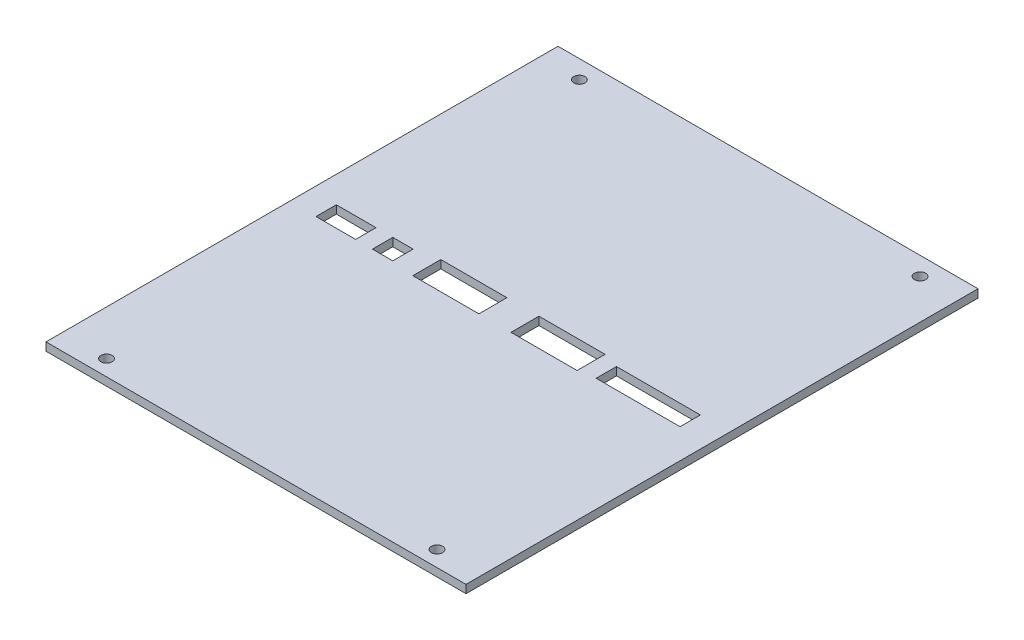
ISO-10303-21;
HEADER;
FILE_DESCRIPTION(('STEP AP214'),'2;1');
FILE_NAME('part.step','',(''),(''),'','','');
FILE_SCHEMA(('AUTOMOTIVE_DESIGN { 1 0 10303 214 1 1 1 1 }'));
ENDSEC;
DATA;
#1=APPLICATION_CONTEXT('core data for automotive mechanical design processes');
#2=APPLICATION_PROTOCOL_DEFINITION('international standard','automotive_design',2000,#1);
#3=PRODUCT_CONTEXT('',#1,'mechanical');
#4=PRODUCT('Part','Part','',(#3));
#5=PRODUCT_RELATED_PRODUCT_CATEGORY('part','',(#4));
#6=PRODUCT_DEFINITION_FORMATION('','',#4);
#7=PRODUCT_DEFINITION_CONTEXT('part definition',#1,'design');
#8=PRODUCT_DEFINITION('design','',#6,#7);
#9=PRODUCT_DEFINITION_SHAPE('','',#8);
#10=(LENGTH_UNIT() NAMED_UNIT(*) SI_UNIT(.MILLI.,.METRE.));
#11=(NAMED_UNIT(*) PLANE_ANGLE_UNIT() SI_UNIT($,.RADIAN.));
#12=(NAMED_UNIT(*) SI_UNIT($,.STERADIAN.) SOLID_ANGLE_UNIT());
#13=UNCERTAINTY_MEASURE_WITH_UNIT(LENGTH_MEASURE(1.E-05),#10,'distance_accuracy_value','');
#14=(GEOMETRIC_REPRESENTATION_CONTEXT(3) GLOBAL_UNCERTAINTY_ASSIGNED_CONTEXT((#13)) GLOBAL_UNIT_ASSIGNED_CONTEXT((#10,
#11,#12)) REPRESENTATION_CONTEXT('',''));
#15=CARTESIAN_POINT('',(0.,0.,0.));
#16=DIRECTION('',(0.,0.,1.));
#17=DIRECTION('',(1.,0.,0.));
#18=AXIS2_PLACEMENT_3D('',#15,#16,#17);
#19=CARTESIAN_POINT('',(0.,1.6,0.));
#20=DIRECTION('',(0.,-1.,0.));
#21=DIRECTION('',(0.,0.,-1.));
#22=AXIS2_PLACEMENT_3D('',#19,#20,#21);
#23=PLANE('',#22);
#24=CARTESIAN_POINT('',(-9.75999999999997,1.6,-27.8625473621053));
#25=DIRECTION('',(0.,1.,0.));
#26=DIRECTION('',(0.,0.,1.));
#27=AXIS2_PLACEMENT_3D('',#24,#25,#26);
#28=CIRCLE('',#27,1.1);
#29=CARTESIAN_POINT('',(-9.75999999999997,1.6,-26.7625473621053));
#30=VERTEX_POINT('',#29);
#31=EDGE_CURVE('E426',#30,#30,#28,.T.);
#32=ORIENTED_EDGE('',*,*,#31,.F.);
#33=EDGE_LOOP('',(#32));
#34=FACE_BOUND('',#33,.T.);
#35=CARTESIAN_POINT('',(57.24,1.6,-27.8625473621053));
#36=DIRECTION('',(0.,1.,0.));
#37=DIRECTION('',(0.,0.,1.));
#38=AXIS2_PLACEMENT_3D('',#35,#36,#37);
#39=CIRCLE('',#38,1.1);
#40=CARTESIAN_POINT('',(57.24,1.6,-26.7625473621053));
#41=VERTEX_POINT('',#40);
#42=EDGE_CURVE('E436',#41,#41,#39,.T.);
#43=ORIENTED_EDGE('',*,*,#42,.F.);
#44=EDGE_LOOP('',(#43));
#45=FACE_BOUND('',#44,.T.);
#46=CARTESIAN_POINT('',(56.24,1.6,66.1374526378947));
#47=DIRECTION('',(0.,1.,0.));
#48=DIRECTION('',(0.,0.,1.));
#49=AXIS2_PLACEMENT_3D('',#46,#47,#48);
#50=CIRCLE('',#49,1.1);
#51=CARTESIAN_POINT('',(56.24,1.6,67.2374526378947));
#52=VERTEX_POINT('',#51);
#53=EDGE_CURVE('E219',#52,#52,#50,.T.);
#54=ORIENTED_EDGE('',*,*,#53,.F.);
#55=EDGE_LOOP('',(#54));
#56=FACE_BOUND('',#55,.T.);
#57=CARTESIAN_POINT('',(-8.75999999999998,1.6,66.1374526378947));
#58=DIRECTION('',(0.,1.,0.));
#59=DIRECTION('',(0.,0.,1.));
#60=AXIS2_PLACEMENT_3D('',#57,#58,#59);
#61=CIRCLE('',#60,1.1);
#62=CARTESIAN_POINT('',(-8.75999999999998,1.6,67.2374526378947));
#63=VERTEX_POINT('',#62);
#64=EDGE_CURVE('E230',#63,#63,#61,.T.);
#65=ORIENTED_EDGE('',*,*,#64,.F.);
#66=EDGE_LOOP('',(#65));
#67=FACE_BOUND('',#66,.T.);
#68=DIRECTION('',(1.,0.,0.));
#69=VECTOR('',#68,1.);
#70=CARTESIAN_POINT('',(-1.25999999999997,1.6,21.3374526378947));
#71=LINE('',#70,#69);
#72=CARTESIAN_POINT('',(-1.25999999999997,1.6,21.3374526378947));
#73=VERTEX_POINT('',#72);
#74=CARTESIAN_POINT('',(2.74000000000003,1.6,21.3374526378947));
#75=VERTEX_POINT('',#74);
#76=EDGE_CURVE('E238',#73,#75,#71,.T.);
#77=ORIENTED_EDGE('',*,*,#76,.F.);
#78=DIRECTION('',(0.,0.,1.));
#79=VECTOR('',#78,1.);
#80=CARTESIAN_POINT('',(-1.25999999999997,1.6,17.3374526378947));
#81=LINE('',#80,#79);
#82=CARTESIAN_POINT('',(-1.25999999999997,1.6,17.3374526378947));
#83=VERTEX_POINT('',#82);
#84=EDGE_CURVE('E236',#83,#73,#81,.T.);
#85=ORIENTED_EDGE('',*,*,#84,.F.);
#86=DIRECTION('',(-1.,0.,0.));
#87=VECTOR('',#86,1.);
#88=CARTESIAN_POINT('',(-1.25999999999997,1.6,17.3374526378947));
#89=LINE('',#88,#87);
#90=CARTESIAN_POINT('',(2.74000000000003,1.6,17.3374526378947));
#91=VERTEX_POINT('',#90);
#92=EDGE_CURVE('E244',#91,#83,#89,.T.);
#93=ORIENTED_EDGE('',*,*,#92,.F.);
#94=DIRECTION('',(0.,0.,-1.));
#95=VECTOR('',#94,1.);
#96=CARTESIAN_POINT('',(2.74000000000003,1.6,17.3374526378947));
#97=LINE('',#96,#95);
#98=EDGE_CURVE('E241',#75,#91,#97,.T.);
#99=ORIENTED_EDGE('',*,*,#98,.F.);
#100=EDGE_LOOP('',(#77,#85,#93,#99));
#101=FACE_BOUND('',#100,.T.);
#102=DIRECTION('',(1.,0.,0.));
#103=VECTOR('',#102,1.);
#104=CARTESIAN_POINT('',(26.54,1.6,21.8874526378947));
#105=LINE('',#104,#103);
#106=CARTESIAN_POINT('',(26.54,1.6,21.8874526378947));
#107=VERTEX_POINT('',#106);
#108=CARTESIAN_POINT('',(39.54,1.6,21.8874526378947));
#109=VERTEX_POINT('',#108);
#110=EDGE_CURVE('E258',#107,#109,#105,.T.);
#111=ORIENTED_EDGE('',*,*,#110,.F.);
#112=DIRECTION('',(0.,0.,1.));
#113=VECTOR('',#112,1.);
#114=CARTESIAN_POINT('',(26.54,1.6,16.3874526378947));
#115=LINE('',#114,#113);
#116=CARTESIAN_POINT('',(26.54,1.6,16.3874526378947));
#117=VERTEX_POINT('',#116);
#118=EDGE_CURVE('E250',#117,#107,#115,.T.);
#119=ORIENTED_EDGE('',*,*,#118,.F.);
#120=DIRECTION('',(-1.,0.,0.));
#121=VECTOR('',#120,1.);
#122=CARTESIAN_POINT('',(26.54,1.6,16.3874526378947));
#123=LINE('',#122,#121);
#124=CARTESIAN_POINT('',(39.54,1.6,16.3874526378947));
#125=VERTEX_POINT('',#124);
#126=EDGE_CURVE('E264',#125,#117,#123,.T.);
#127=ORIENTED_EDGE('',*,*,#126,.F.);
#128=DIRECTION('',(0.,0.,-1.));
#129=VECTOR('',#128,1.);
#130=CARTESIAN_POINT('',(39.54,1.6,16.3874526378947));
#131=LINE('',#130,#129);
#132=EDGE_CURVE('E261',#109,#125,#131,.T.);
#133=ORIENTED_EDGE('',*,*,#132,.F.);
#134=EDGE_LOOP('',(#111,#119,#127,#133));
#135=FACE_BOUND('',#134,.T.);
#136=DIRECTION('',(1.,0.,0.));
#137=VECTOR('',#136,1.);
#138=CARTESIAN_POINT('',(-12.36,1.6,21.3374526378947));
#139=LINE('',#138,#137);
#140=CARTESIAN_POINT('',(-12.36,1.6,21.3374526378947));
#141=VERTEX_POINT('',#140);
#142=CARTESIAN_POINT('',(-4.55999999999997,1.6,21.3374526378947));
#143=VERTEX_POINT('',#142);
#144=EDGE_CURVE('E278',#141,#143,#139,.T.);
#145=ORIENTED_EDGE('',*,*,#144,.F.);
#146=DIRECTION('',(0.,0.,1.));
#147=VECTOR('',#146,1.);
#148=CARTESIAN_POINT('',(-12.36,1.6,17.3374526378947));
#149=LINE('',#148,#147);
#150=CARTESIAN_POINT('',(-12.36,1.6,17.3374526378947));
#151=VERTEX_POINT('',#150);
#152=EDGE_CURVE('E270',#151,#141,#149,.T.);
#153=ORIENTED_EDGE('',*,*,#152,.F.);
#154=DIRECTION('',(-1.,0.,0.));
#155=VECTOR('',#154,1.);
#156=CARTESIAN_POINT('',(-12.36,1.6,17.3374526378947));
#157=LINE('',#156,#155);
#158=CARTESIAN_POINT('',(-4.55999999999997,1.6,17.3374526378947));
#159=VERTEX_POINT('',#158);
#160=EDGE_CURVE('E284',#159,#151,#157,.T.);
#161=ORIENTED_EDGE('',*,*,#160,.F.);
#162=DIRECTION('',(0.,0.,-1.));
#163=VECTOR('',#162,1.);
#164=CARTESIAN_POINT('',(-4.55999999999997,1.6,17.3374526378947));
#165=LINE('',#164,#163);
#166=EDGE_CURVE('E281',#143,#159,#165,.T.);
#167=ORIENTED_EDGE('',*,*,#166,.F.);
#168=EDGE_LOOP('',(#145,#153,#161,#167));
#169=FACE_BOUND('',#168,.T.);
#170=DIRECTION('',(1.,0.,0.));
#171=VECTOR('',#170,1.);
#172=CARTESIAN_POINT('',(42.74,1.6,21.3374526378947));
#173=LINE('',#172,#171);
#174=CARTESIAN_POINT('',(42.74,1.6,21.3374526378947));
#175=VERTEX_POINT('',#174);
#176=CARTESIAN_POINT('',(59.24,1.6,21.3374526378947));
#177=VERTEX_POINT('',#176);
#178=EDGE_CURVE('E298',#175,#177,#173,.T.);
#179=ORIENTED_EDGE('',*,*,#178,.F.);
#180=DIRECTION('',(0.,0.,1.));
#181=VECTOR('',#180,1.);
#182=CARTESIAN_POINT('',(42.74,1.6,17.3374526378947));
#183=LINE('',#182,#181);
#184=CARTESIAN_POINT('',(42.74,1.6,17.3374526378947));
#185=VERTEX_POINT('',#184);
#186=EDGE_CURVE('E290',#185,#175,#183,.T.);
#187=ORIENTED_EDGE('',*,*,#186,.F.);
#188=DIRECTION('',(-1.,0.,0.));
#189=VECTOR('',#188,1.);
#190=CARTESIAN_POINT('',(42.74,1.6,17.3374526378947));
#191=LINE('',#190,#189);
#192=CARTESIAN_POINT('',(59.24,1.6,17.3374526378947));
#193=VERTEX_POINT('',#192);
#194=EDGE_CURVE('E304',#193,#185,#191,.T.);
#195=ORIENTED_EDGE('',*,*,#194,.F.);
#196=DIRECTION('',(0.,0.,-1.));
#197=VECTOR('',#196,1.);
#198=CARTESIAN_POINT('',(59.24,1.6,17.3374526378947));
#199=LINE('',#198,#197);
#200=EDGE_CURVE('E301',#177,#193,#199,.T.);
#201=ORIENTED_EDGE('',*,*,#200,.F.);
#202=EDGE_LOOP('',(#179,#187,#195,#201));
#203=FACE_BOUND('',#202,.T.);
#204=DIRECTION('',(1.,0.,0.));
#205=VECTOR('',#204,1.);
#206=CARTESIAN_POINT('',(7.24000000000003,1.6,21.8874526378947));
#207=LINE('',#206,#205);
#208=CARTESIAN_POINT('',(7.24000000000003,1.6,21.8874526378947));
#209=VERTEX_POINT('',#208);
#210=CARTESIAN_POINT('',(20.24,1.6,21.8874526378947));
#211=VERTEX_POINT('',#210);
#212=EDGE_CURVE('E318',#209,#211,#207,.T.);
#213=ORIENTED_EDGE('',*,*,#212,.F.);
#214=DIRECTION('',(0.,0.,1.));
#215=VECTOR('',#214,1.);
#216=CARTESIAN_POINT('',(7.24000000000003,1.6,16.3874526378947));
#217=LINE('',#216,#215);
#218=CARTESIAN_POINT('',(7.24000000000003,1.6,16.3874526378947));
#219=VERTEX_POINT('',#218);
#220=EDGE_CURVE('E310',#219,#209,#217,.T.);
#221=ORIENTED_EDGE('',*,*,#220,.F.);
#222=DIRECTION('',(-1.,0.,0.));
#223=VECTOR('',#222,1.);
#224=CARTESIAN_POINT('',(7.24000000000003,1.6,16.3874526378947));
#225=LINE('',#224,#223);
#226=CARTESIAN_POINT('',(20.24,1.6,16.3874526378948));
#227=VERTEX_POINT('',#226);
#228=EDGE_CURVE('E324',#227,#219,#225,.T.);
#229=ORIENTED_EDGE('',*,*,#228,.F.);
#230=DIRECTION('',(0.,0.,-1.));
#231=VECTOR('',#230,1.);
#232=CARTESIAN_POINT('',(20.24,1.6,16.3874526378948));
#233=LINE('',#232,#231);
#234=EDGE_CURVE('E321',#211,#227,#233,.T.);
#235=ORIENTED_EDGE('',*,*,#234,.F.);
#236=EDGE_LOOP('',(#213,#221,#229,#235));
#237=FACE_BOUND('',#236,.T.);
#238=DIRECTION('',(-1.,0.,0.));
#239=VECTOR('',#238,1.);
#240=CARTESIAN_POINT('',(-17.76,1.6,69.2374526378948));
#241=LINE('',#240,#239);
#242=CARTESIAN_POINT('',(65.04,1.6,69.2374526378948));
#243=VERTEX_POINT('',#242);
#244=CARTESIAN_POINT('',(-17.56,1.6,69.2374526378948));
#245=VERTEX_POINT('',#244);
#246=EDGE_CURVE('E217',#243,#245,#241,.T.);
#247=ORIENTED_EDGE('',*,*,#246,.F.);
#248=DIRECTION('',(0.,0.,1.));
#249=VECTOR('',#248,1.);
#250=CARTESIAN_POINT('',(65.04,1.6,69.2374526378948));
#251=LINE('',#250,#249);
#252=CARTESIAN_POINT('',(65.04,1.6,-31.4625473621052));
#253=VERTEX_POINT('',#252);
#254=EDGE_CURVE('E53',#253,#243,#251,.T.);
#255=ORIENTED_EDGE('',*,*,#254,.F.);
#256=DIRECTION('',(1.,0.,0.));
#257=VECTOR('',#256,1.);
#258=CARTESIAN_POINT('',(65.24,1.6,-31.4625473621052));
#259=LINE('',#258,#257);
#260=CARTESIAN_POINT('',(-17.56,1.6,-31.4625473621053));
#261=VERTEX_POINT('',#260);
#262=EDGE_CURVE('E214',#261,#253,#259,.T.);
#263=ORIENTED_EDGE('',*,*,#262,.F.);
#264=DIRECTION('',(0.,0.,-1.));
#265=VECTOR('',#264,1.);
#266=CARTESIAN_POINT('',(-17.56,1.6,-31.4625473621053));
#267=LINE('',#266,#265);
#268=EDGE_CURVE('E419',#245,#261,#267,.T.);
#269=ORIENTED_EDGE('',*,*,#268,.F.);
#270=EDGE_LOOP('',(#247,#255,#263,#269));
#271=FACE_BOUND('',#270,.T.);
#272=ADVANCED_FACE('F38',(#34,#45,#56,#67,#101,#135,#169,#203,#237,#271),#23,.F.);
#273=CARTESIAN_POINT('',(0.,0.,0.));
#274=DIRECTION('',(0.,-1.,0.));
#275=DIRECTION('',(0.,0.,-1.));
#276=AXIS2_PLACEMENT_3D('',#273,#274,#275);
#277=PLANE('',#276);
#278=DIRECTION('',(0.,0.,1.));
#279=VECTOR('',#278,1.);
#280=CARTESIAN_POINT('',(65.04,0.,69.2374526378948));
#281=LINE('',#280,#279);
#282=CARTESIAN_POINT('',(65.04,0.,-31.4625473621052));
#283=VERTEX_POINT('',#282);
#284=CARTESIAN_POINT('',(65.04,0.,69.2374526378948));
#285=VERTEX_POINT('',#284);
#286=EDGE_CURVE('E198',#283,#285,#281,.T.);
#287=ORIENTED_EDGE('',*,*,#286,.T.);
#288=DIRECTION('',(1.,0.,0.));
#289=VECTOR('',#288,1.);
#290=CARTESIAN_POINT('',(-17.76,0.,69.2374526378948));
#291=LINE('',#290,#289);
#292=CARTESIAN_POINT('',(-17.56,0.,69.2374526378948));
#293=VERTEX_POINT('',#292);
#294=EDGE_CURVE('E221',#293,#285,#291,.T.);
#295=ORIENTED_EDGE('',*,*,#294,.F.);
#296=DIRECTION('',(0.,0.,-1.));
#297=VECTOR('',#296,1.);
#298=CARTESIAN_POINT('',(-17.56,0.,-31.4625473621053));
#299=LINE('',#298,#297);
#300=CARTESIAN_POINT('',(-17.56,0.,-31.4625473621053));
#301=VERTEX_POINT('',#300);
#302=EDGE_CURVE('E61',#293,#301,#299,.T.);
#303=ORIENTED_EDGE('',*,*,#302,.T.);
#304=DIRECTION('',(-1.,0.,0.));
#305=VECTOR('',#304,1.);
#306=CARTESIAN_POINT('',(65.24,0.,-31.4625473621052));
#307=LINE('',#306,#305);
#308=EDGE_CURVE('E212',#283,#301,#307,.T.);
#309=ORIENTED_EDGE('',*,*,#308,.F.);
#310=EDGE_LOOP('',(#287,#295,#303,#309));
#311=FACE_BOUND('',#310,.T.);
#312=CARTESIAN_POINT('',(-9.75999999999997,0.,-27.8625473621053));
#313=DIRECTION('',(0.,1.,0.));
#314=DIRECTION('',(0.,0.,1.));
#315=AXIS2_PLACEMENT_3D('',#312,#313,#314);
#316=CIRCLE('',#315,1.1);
#317=CARTESIAN_POINT('',(-9.75999999999997,0.,-26.7625473621053));
#318=VERTEX_POINT('',#317);
#319=EDGE_CURVE('E433',#318,#318,#316,.T.);
#320=ORIENTED_EDGE('',*,*,#319,.T.);
#321=EDGE_LOOP('',(#320));
#322=FACE_BOUND('',#321,.T.);
#323=CARTESIAN_POINT('',(57.24,0.,-27.8625473621053));
#324=DIRECTION('',(0.,1.,0.));
#325=DIRECTION('',(0.,0.,1.));
#326=AXIS2_PLACEMENT_3D('',#323,#324,#325);
#327=CIRCLE('',#326,1.1);
#328=CARTESIAN_POINT('',(57.24,0.,-26.7625473621053));
#329=VERTEX_POINT('',#328);
#330=EDGE_CURVE('E439',#329,#329,#327,.T.);
#331=ORIENTED_EDGE('',*,*,#330,.T.);
#332=EDGE_LOOP('',(#331));
#333=FACE_BOUND('',#332,.T.);
#334=CARTESIAN_POINT('',(56.24,0.,66.1374526378947));
#335=DIRECTION('',(0.,-1.,0.));
#336=DIRECTION('',(0.,0.,-1.));
#337=AXIS2_PLACEMENT_3D('',#334,#335,#336);
#338=CIRCLE('',#337,1.1);
#339=CARTESIAN_POINT('',(56.24,0.,65.0374526378947));
#340=VERTEX_POINT('',#339);
#341=EDGE_CURVE('E227',#340,#340,#338,.T.);
#342=ORIENTED_EDGE('',*,*,#341,.F.);
#343=EDGE_LOOP('',(#342));
#344=FACE_BOUND('',#343,.T.);
#345=CARTESIAN_POINT('',(-8.75999999999998,0.,66.1374526378947));
#346=DIRECTION('',(0.,-1.,0.));
#347=DIRECTION('',(0.,0.,-1.));
#348=AXIS2_PLACEMENT_3D('',#345,#346,#347);
#349=CIRCLE('',#348,1.1);
#350=CARTESIAN_POINT('',(-8.75999999999998,0.,65.0374526378947));
#351=VERTEX_POINT('',#350);
#352=EDGE_CURVE('E233',#351,#351,#349,.T.);
#353=ORIENTED_EDGE('',*,*,#352,.F.);
#354=EDGE_LOOP('',(#353));
#355=FACE_BOUND('',#354,.T.);
#356=DIRECTION('',(0.,0.,-1.));
#357=VECTOR('',#356,1.);
#358=CARTESIAN_POINT('',(-1.25999999999997,0.,0.));
#359=LINE('',#358,#357);
#360=CARTESIAN_POINT('',(-1.25999999999997,0.,21.3374526378947));
#361=VERTEX_POINT('',#360);
#362=CARTESIAN_POINT('',(-1.25999999999997,0.,17.3374526378947));
#363=VERTEX_POINT('',#362);
#364=EDGE_CURVE('E11',#361,#363,#359,.T.);
#365=ORIENTED_EDGE('',*,*,#364,.F.);
#366=DIRECTION('',(-1.,0.,0.));
#367=VECTOR('',#366,1.);
#368=CARTESIAN_POINT('',(0.,0.,21.3374526378947));
#369=LINE('',#368,#367);
#370=CARTESIAN_POINT('',(2.74000000000003,0.,21.3374526378947));
#371=VERTEX_POINT('',#370);
#372=EDGE_CURVE('E372',#371,#361,#369,.T.);
#373=ORIENTED_EDGE('',*,*,#372,.F.);
#374=DIRECTION('',(0.,0.,1.));
#375=VECTOR('',#374,1.);
#376=CARTESIAN_POINT('',(2.74000000000003,0.,0.));
#377=LINE('',#376,#375);
#378=CARTESIAN_POINT('',(2.74000000000003,0.,17.3374526378947));
#379=VERTEX_POINT('',#378);
#380=EDGE_CURVE('E374',#379,#371,#377,.T.);
#381=ORIENTED_EDGE('',*,*,#380,.F.);
#382=DIRECTION('',(1.,0.,0.));
#383=VECTOR('',#382,1.);
#384=CARTESIAN_POINT('',(0.,0.,17.3374526378947));
#385=LINE('',#384,#383);
#386=EDGE_CURVE('E46',#363,#379,#385,.T.);
#387=ORIENTED_EDGE('',*,*,#386,.F.);
#388=EDGE_LOOP('',(#365,#373,#381,#387));
#389=FACE_BOUND('',#388,.T.);
#390=DIRECTION('',(0.,0.,-1.));
#391=VECTOR('',#390,1.);
#392=CARTESIAN_POINT('',(26.54,0.,0.));
#393=LINE('',#392,#391);
#394=CARTESIAN_POINT('',(26.54,0.,21.8874526378947));
#395=VERTEX_POINT('',#394);
#396=CARTESIAN_POINT('',(26.54,0.,16.3874526378947));
#397=VERTEX_POINT('',#396);
#398=EDGE_CURVE('E370',#395,#397,#393,.T.);
#399=ORIENTED_EDGE('',*,*,#398,.F.);
#400=DIRECTION('',(-1.,0.,0.));
#401=VECTOR('',#400,1.);
#402=CARTESIAN_POINT('',(0.,0.,21.8874526378947));
#403=LINE('',#402,#401);
#404=CARTESIAN_POINT('',(39.54,0.,21.8874526378947));
#405=VERTEX_POINT('',#404);
#406=EDGE_CURVE('E363',#405,#395,#403,.T.);
#407=ORIENTED_EDGE('',*,*,#406,.F.);
#408=DIRECTION('',(0.,0.,1.));
#409=VECTOR('',#408,1.);
#410=CARTESIAN_POINT('',(39.54,0.,0.));
#411=LINE('',#410,#409);
#412=CARTESIAN_POINT('',(39.54,0.,16.3874526378947));
#413=VERTEX_POINT('',#412);
#414=EDGE_CURVE('E365',#413,#405,#411,.T.);
#415=ORIENTED_EDGE('',*,*,#414,.F.);
#416=DIRECTION('',(1.,0.,0.));
#417=VECTOR('',#416,1.);
#418=CARTESIAN_POINT('',(0.,0.,16.3874526378947));
#419=LINE('',#418,#417);
#420=EDGE_CURVE('E368',#397,#413,#419,.T.);
#421=ORIENTED_EDGE('',*,*,#420,.F.);
#422=EDGE_LOOP('',(#399,#407,#415,#421));
#423=FACE_BOUND('',#422,.T.);
#424=DIRECTION('',(0.,0.,-1.));
#425=VECTOR('',#424,1.);
#426=CARTESIAN_POINT('',(-12.36,0.,0.));
#427=LINE('',#426,#425);
#428=CARTESIAN_POINT('',(-12.36,0.,21.3374526378947));
#429=VERTEX_POINT('',#428);
#430=CARTESIAN_POINT('',(-12.36,0.,17.3374526378947));
#431=VERTEX_POINT('',#430);
#432=EDGE_CURVE('E361',#429,#431,#427,.T.);
#433=ORIENTED_EDGE('',*,*,#432,.F.);
#434=DIRECTION('',(-1.,0.,0.));
#435=VECTOR('',#434,1.);
#436=CARTESIAN_POINT('',(0.,0.,21.3374526378947));
#437=LINE('',#436,#435);
#438=CARTESIAN_POINT('',(-4.55999999999997,0.,21.3374526378947));
#439=VERTEX_POINT('',#438);
#440=EDGE_CURVE('E354',#439,#429,#437,.T.);
#441=ORIENTED_EDGE('',*,*,#440,.F.);
#442=DIRECTION('',(0.,0.,1.));
#443=VECTOR('',#442,1.);
#444=CARTESIAN_POINT('',(-4.55999999999998,0.,0.));
#445=LINE('',#444,#443);
#446=CARTESIAN_POINT('',(-4.55999999999997,0.,17.3374526378947));
#447=VERTEX_POINT('',#446);
#448=EDGE_CURVE('E356',#447,#439,#445,.T.);
#449=ORIENTED_EDGE('',*,*,#448,.F.);
#450=DIRECTION('',(1.,0.,0.));
#451=VECTOR('',#450,1.);
#452=CARTESIAN_POINT('',(0.,0.,17.3374526378947));
#453=LINE('',#452,#451);
#454=EDGE_CURVE('E359',#431,#447,#453,.T.);
#455=ORIENTED_EDGE('',*,*,#454,.F.);
#456=EDGE_LOOP('',(#433,#441,#449,#455));
#457=FACE_BOUND('',#456,.T.);
#458=DIRECTION('',(0.,0.,-1.));
#459=VECTOR('',#458,1.);
#460=CARTESIAN_POINT('',(42.74,0.,0.));
#461=LINE('',#460,#459);
#462=CARTESIAN_POINT('',(42.74,0.,21.3374526378947));
#463=VERTEX_POINT('',#462);
#464=CARTESIAN_POINT('',(42.74,0.,17.3374526378947));
#465=VERTEX_POINT('',#464);
#466=EDGE_CURVE('E352',#463,#465,#461,.T.);
#467=ORIENTED_EDGE('',*,*,#466,.F.);
#468=DIRECTION('',(-1.,0.,0.));
#469=VECTOR('',#468,1.);
#470=CARTESIAN_POINT('',(0.,0.,21.3374526378947));
#471=LINE('',#470,#469);
#472=CARTESIAN_POINT('',(59.24,0.,21.3374526378947));
#473=VERTEX_POINT('',#472);
#474=EDGE_CURVE('E345',#473,#463,#471,.T.);
#475=ORIENTED_EDGE('',*,*,#474,.F.);
#476=DIRECTION('',(0.,0.,1.));
#477=VECTOR('',#476,1.);
#478=CARTESIAN_POINT('',(59.24,0.,0.));
#479=LINE('',#478,#477);
#480=CARTESIAN_POINT('',(59.24,0.,17.3374526378947));
#481=VERTEX_POINT('',#480);
#482=EDGE_CURVE('E347',#481,#473,#479,.T.);
#483=ORIENTED_EDGE('',*,*,#482,.F.);
#484=DIRECTION('',(1.,0.,0.));
#485=VECTOR('',#484,1.);
#486=CARTESIAN_POINT('',(0.,0.,17.3374526378947));
#487=LINE('',#486,#485);
#488=EDGE_CURVE('E350',#465,#481,#487,.T.);
#489=ORIENTED_EDGE('',*,*,#488,.F.);
#490=EDGE_LOOP('',(#467,#475,#483,#489));
#491=FACE_BOUND('',#490,.T.);
#492=DIRECTION('',(0.,0.,-1.));
#493=VECTOR('',#492,1.);
#494=CARTESIAN_POINT('',(7.24000000000003,0.,0.));
#495=LINE('',#494,#493);
#496=CARTESIAN_POINT('',(7.24000000000003,0.,21.8874526378947));
#497=VERTEX_POINT('',#496);
#498=CARTESIAN_POINT('',(7.24000000000003,0.,16.3874526378947));
#499=VERTEX_POINT('',#498);
#500=EDGE_CURVE('E343',#497,#499,#495,.T.);
#501=ORIENTED_EDGE('',*,*,#500,.F.);
#502=DIRECTION('',(-1.,0.,0.));
#503=VECTOR('',#502,1.);
#504=CARTESIAN_POINT('',(0.,0.,21.8874526378947));
#505=LINE('',#504,#503);
#506=CARTESIAN_POINT('',(20.24,0.,21.8874526378947));
#507=VERTEX_POINT('',#506);
#508=EDGE_CURVE('E330',#507,#497,#505,.T.);
#509=ORIENTED_EDGE('',*,*,#508,.F.);
#510=DIRECTION('',(0.,0.,1.));
#511=VECTOR('',#510,1.);
#512=CARTESIAN_POINT('',(20.24,0.,0.));
#513=LINE('',#512,#511);
#514=CARTESIAN_POINT('',(20.24,0.,16.3874526378948));
#515=VERTEX_POINT('',#514);
#516=EDGE_CURVE('E338',#515,#507,#513,.T.);
#517=ORIENTED_EDGE('',*,*,#516,.F.);
#518=DIRECTION('',(1.,0.,0.));
#519=VECTOR('',#518,1.);
#520=CARTESIAN_POINT('',(0.,0.,16.3874526378947));
#521=LINE('',#520,#519);
#522=EDGE_CURVE('E341',#499,#515,#521,.T.);
#523=ORIENTED_EDGE('',*,*,#522,.F.);
#524=EDGE_LOOP('',(#501,#509,#517,#523));
#525=FACE_BOUND('',#524,.T.);
#526=ADVANCED_FACE('F40',(#311,#322,#333,#344,#355,#389,#423,#457,#491,#525),#277,.T.);
#527=CARTESIAN_POINT('',(7.24000000000003,-47.4,16.3874526378947));
#528=DIRECTION('',(-1.,0.,0.));
#529=DIRECTION('',(0.,0.,1.));
#530=AXIS2_PLACEMENT_3D('',#527,#528,#529);
#531=PLANE('',#530);
#532=ORIENTED_EDGE('',*,*,#500,.T.);
#533=DIRECTION('',(0.,1.,0.));
#534=VECTOR('',#533,1.);
#535=CARTESIAN_POINT('',(7.24000000000003,-47.4,16.3874526378947));
#536=LINE('',#535,#534);
#537=EDGE_CURVE('E328',#499,#219,#536,.T.);
#538=ORIENTED_EDGE('',*,*,#537,.T.);
#539=ORIENTED_EDGE('',*,*,#220,.T.);
#540=DIRECTION('',(0.,1.,0.));
#541=VECTOR('',#540,1.);
#542=CARTESIAN_POINT('',(7.24000000000003,-47.4,21.8874526378947));
#543=LINE('',#542,#541);
#544=EDGE_CURVE('E327',#497,#209,#543,.T.);
#545=ORIENTED_EDGE('',*,*,#544,.F.);
#546=EDGE_LOOP('',(#532,#538,#539,#545));
#547=FACE_BOUND('',#546,.T.);
#548=ADVANCED_FACE('F530',(#547),#531,.F.);
#549=CARTESIAN_POINT('',(7.24000000000003,-47.4,16.3874526378947));
#550=DIRECTION('',(0.,0.,-1.));
#551=DIRECTION('',(-1.,0.,0.));
#552=AXIS2_PLACEMENT_3D('',#549,#550,#551);
#553=PLANE('',#552);
#554=ORIENTED_EDGE('',*,*,#522,.T.);
#555=DIRECTION('',(0.,1.,0.));
#556=VECTOR('',#555,1.);
#557=CARTESIAN_POINT('',(20.24,-47.4,16.3874526378948));
#558=LINE('',#557,#556);
#559=EDGE_CURVE('E331',#515,#227,#558,.T.);
#560=ORIENTED_EDGE('',*,*,#559,.T.);
#561=ORIENTED_EDGE('',*,*,#228,.T.);
#562=ORIENTED_EDGE('',*,*,#537,.F.);
#563=EDGE_LOOP('',(#554,#560,#561,#562));
#564=FACE_BOUND('',#563,.T.);
#565=ADVANCED_FACE('F526',(#564),#553,.F.);
#566=CARTESIAN_POINT('',(20.24,-47.4,16.3874526378948));
#567=DIRECTION('',(1.,0.,0.));
#568=DIRECTION('',(0.,0.,-1.));
#569=AXIS2_PLACEMENT_3D('',#566,#567,#568);
#570=PLANE('',#569);
#571=ORIENTED_EDGE('',*,*,#516,.T.);
#572=DIRECTION('',(0.,1.,0.));
#573=VECTOR('',#572,1.);
#574=CARTESIAN_POINT('',(20.24,-47.4,21.8874526378947));
#575=LINE('',#574,#573);
#576=EDGE_CURVE('E333',#507,#211,#575,.T.);
#577=ORIENTED_EDGE('',*,*,#576,.T.);
#578=ORIENTED_EDGE('',*,*,#234,.T.);
#579=ORIENTED_EDGE('',*,*,#559,.F.);
#580=EDGE_LOOP('',(#571,#577,#578,#579));
#581=FACE_BOUND('',#580,.T.);
#582=ADVANCED_FACE('F529',(#581),#570,.F.);
#583=CARTESIAN_POINT('',(7.24000000000003,-47.4,21.8874526378947));
#584=DIRECTION('',(0.,0.,1.));
#585=DIRECTION('',(1.,0.,0.));
#586=AXIS2_PLACEMENT_3D('',#583,#584,#585);
#587=PLANE('',#586);
#588=ORIENTED_EDGE('',*,*,#508,.T.);
#589=ORIENTED_EDGE('',*,*,#544,.T.);
#590=ORIENTED_EDGE('',*,*,#212,.T.);
#591=ORIENTED_EDGE('',*,*,#576,.F.);
#592=EDGE_LOOP('',(#588,#589,#590,#591));
#593=FACE_BOUND('',#592,.T.);
#594=ADVANCED_FACE('F524',(#593),#587,.F.);
#595=CARTESIAN_POINT('',(42.74,-47.4,17.3374526378947));
#596=DIRECTION('',(-1.,0.,0.));
#597=DIRECTION('',(0.,0.,1.));
#598=AXIS2_PLACEMENT_3D('',#595,#596,#597);
#599=PLANE('',#598);
#600=ORIENTED_EDGE('',*,*,#466,.T.);
#601=DIRECTION('',(0.,1.,0.));
#602=VECTOR('',#601,1.);
#603=CARTESIAN_POINT('',(42.74,-47.4,17.3374526378947));
#604=LINE('',#603,#602);
#605=EDGE_CURVE('E308',#465,#185,#604,.T.);
#606=ORIENTED_EDGE('',*,*,#605,.T.);
#607=ORIENTED_EDGE('',*,*,#186,.T.);
#608=DIRECTION('',(0.,1.,0.));
#609=VECTOR('',#608,1.);
#610=CARTESIAN_POINT('',(42.74,-47.4,21.3374526378947));
#611=LINE('',#610,#609);
#612=EDGE_CURVE('E307',#463,#175,#611,.T.);
#613=ORIENTED_EDGE('',*,*,#612,.F.);
#614=EDGE_LOOP('',(#600,#606,#607,#613));
#615=FACE_BOUND('',#614,.T.);
#616=ADVANCED_FACE('F514',(#615),#599,.F.);
#617=CARTESIAN_POINT('',(42.74,-47.4,17.3374526378947));
#618=DIRECTION('',(0.,0.,-1.));
#619=DIRECTION('',(-1.,0.,0.));
#620=AXIS2_PLACEMENT_3D('',#617,#618,#619);
#621=PLANE('',#620);
#622=ORIENTED_EDGE('',*,*,#488,.T.);
#623=DIRECTION('',(0.,1.,0.));
#624=VECTOR('',#623,1.);
#625=CARTESIAN_POINT('',(59.24,-47.4,17.3374526378947));
#626=LINE('',#625,#624);
#627=EDGE_CURVE('E311',#481,#193,#626,.T.);
#628=ORIENTED_EDGE('',*,*,#627,.T.);
#629=ORIENTED_EDGE('',*,*,#194,.T.);
#630=ORIENTED_EDGE('',*,*,#605,.F.);
#631=EDGE_LOOP('',(#622,#628,#629,#630));
#632=FACE_BOUND('',#631,.T.);
#633=ADVANCED_FACE('F510',(#632),#621,.F.);
#634=CARTESIAN_POINT('',(59.24,-47.4,17.3374526378947));
#635=DIRECTION('',(1.,0.,0.));
#636=DIRECTION('',(0.,0.,-1.));
#637=AXIS2_PLACEMENT_3D('',#634,#635,#636);
#638=PLANE('',#637);
#639=ORIENTED_EDGE('',*,*,#482,.T.);
#640=DIRECTION('',(0.,1.,0.));
#641=VECTOR('',#640,1.);
#642=CARTESIAN_POINT('',(59.24,-47.4,21.3374526378947));
#643=LINE('',#642,#641);
#644=EDGE_CURVE('E313',#473,#177,#643,.T.);
#645=ORIENTED_EDGE('',*,*,#644,.T.);
#646=ORIENTED_EDGE('',*,*,#200,.T.);
#647=ORIENTED_EDGE('',*,*,#627,.F.);
#648=EDGE_LOOP('',(#639,#645,#646,#647));
#649=FACE_BOUND('',#648,.T.);
#650=ADVANCED_FACE('F513',(#649),#638,.F.);
#651=CARTESIAN_POINT('',(42.74,-47.4,21.3374526378947));
#652=DIRECTION('',(0.,0.,1.));
#653=DIRECTION('',(1.,0.,0.));
#654=AXIS2_PLACEMENT_3D('',#651,#652,#653);
#655=PLANE('',#654);
#656=ORIENTED_EDGE('',*,*,#474,.T.);
#657=ORIENTED_EDGE('',*,*,#612,.T.);
#658=ORIENTED_EDGE('',*,*,#178,.T.);
#659=ORIENTED_EDGE('',*,*,#644,.F.);
#660=EDGE_LOOP('',(#656,#657,#658,#659));
#661=FACE_BOUND('',#660,.T.);
#662=ADVANCED_FACE('F508',(#661),#655,.F.);
#663=CARTESIAN_POINT('',(-12.36,-47.4,17.3374526378947));
#664=DIRECTION('',(-1.,0.,0.));
#665=DIRECTION('',(0.,0.,1.));
#666=AXIS2_PLACEMENT_3D('',#663,#664,#665);
#667=PLANE('',#666);
#668=ORIENTED_EDGE('',*,*,#432,.T.);
#669=DIRECTION('',(0.,1.,0.));
#670=VECTOR('',#669,1.);
#671=CARTESIAN_POINT('',(-12.36,-47.4,17.3374526378947));
#672=LINE('',#671,#670);
#673=EDGE_CURVE('E288',#431,#151,#672,.T.);
#674=ORIENTED_EDGE('',*,*,#673,.T.);
#675=ORIENTED_EDGE('',*,*,#152,.T.);
#676=DIRECTION('',(0.,1.,0.));
#677=VECTOR('',#676,1.);
#678=CARTESIAN_POINT('',(-12.36,-47.4,21.3374526378947));
#679=LINE('',#678,#677);
#680=EDGE_CURVE('E287',#429,#141,#679,.T.);
#681=ORIENTED_EDGE('',*,*,#680,.F.);
#682=EDGE_LOOP('',(#668,#674,#675,#681));
#683=FACE_BOUND('',#682,.T.);
#684=ADVANCED_FACE('F498',(#683),#667,.F.);
#685=CARTESIAN_POINT('',(-12.36,-47.4,17.3374526378947));
#686=DIRECTION('',(0.,0.,-1.));
#687=DIRECTION('',(-1.,0.,0.));
#688=AXIS2_PLACEMENT_3D('',#685,#686,#687);
#689=PLANE('',#688);
#690=ORIENTED_EDGE('',*,*,#454,.T.);
#691=DIRECTION('',(0.,1.,0.));
#692=VECTOR('',#691,1.);
#693=CARTESIAN_POINT('',(-4.55999999999997,-47.4,17.3374526378947));
#694=LINE('',#693,#692);
#695=EDGE_CURVE('E291',#447,#159,#694,.T.);
#696=ORIENTED_EDGE('',*,*,#695,.T.);
#697=ORIENTED_EDGE('',*,*,#160,.T.);
#698=ORIENTED_EDGE('',*,*,#673,.F.);
#699=EDGE_LOOP('',(#690,#696,#697,#698));
#700=FACE_BOUND('',#699,.T.);
#701=ADVANCED_FACE('F494',(#700),#689,.F.);
#702=CARTESIAN_POINT('',(-4.55999999999997,-47.4,17.3374526378947));
#703=DIRECTION('',(1.,0.,0.));
#704=DIRECTION('',(0.,0.,-1.));
#705=AXIS2_PLACEMENT_3D('',#702,#703,#704);
#706=PLANE('',#705);
#707=ORIENTED_EDGE('',*,*,#448,.T.);
#708=DIRECTION('',(0.,1.,0.));
#709=VECTOR('',#708,1.);
#710=CARTESIAN_POINT('',(-4.55999999999997,-47.4,21.3374526378947));
#711=LINE('',#710,#709);
#712=EDGE_CURVE('E293',#439,#143,#711,.T.);
#713=ORIENTED_EDGE('',*,*,#712,.T.);
#714=ORIENTED_EDGE('',*,*,#166,.T.);
#715=ORIENTED_EDGE('',*,*,#695,.F.);
#716=EDGE_LOOP('',(#707,#713,#714,#715));
#717=FACE_BOUND('',#716,.T.);
#718=ADVANCED_FACE('F497',(#717),#706,.F.);
#719=CARTESIAN_POINT('',(-12.36,-47.4,21.3374526378947));
#720=DIRECTION('',(0.,0.,1.));
#721=DIRECTION('',(1.,0.,0.));
#722=AXIS2_PLACEMENT_3D('',#719,#720,#721);
#723=PLANE('',#722);
#724=ORIENTED_EDGE('',*,*,#440,.T.);
#725=ORIENTED_EDGE('',*,*,#680,.T.);
#726=ORIENTED_EDGE('',*,*,#144,.T.);
#727=ORIENTED_EDGE('',*,*,#712,.F.);
#728=EDGE_LOOP('',(#724,#725,#726,#727));
#729=FACE_BOUND('',#728,.T.);
#730=ADVANCED_FACE('F492',(#729),#723,.F.);
#731=CARTESIAN_POINT('',(26.54,-47.4,16.3874526378947));
#732=DIRECTION('',(-1.,0.,0.));
#733=DIRECTION('',(0.,0.,1.));
#734=AXIS2_PLACEMENT_3D('',#731,#732,#733);
#735=PLANE('',#734);
#736=ORIENTED_EDGE('',*,*,#398,.T.);
#737=DIRECTION('',(0.,1.,0.));
#738=VECTOR('',#737,1.);
#739=CARTESIAN_POINT('',(26.54,-47.4,16.3874526378947));
#740=LINE('',#739,#738);
#741=EDGE_CURVE('E268',#397,#117,#740,.T.);
#742=ORIENTED_EDGE('',*,*,#741,.T.);
#743=ORIENTED_EDGE('',*,*,#118,.T.);
#744=DIRECTION('',(0.,1.,0.));
#745=VECTOR('',#744,1.);
#746=CARTESIAN_POINT('',(26.54,-47.4,21.8874526378947));
#747=LINE('',#746,#745);
#748=EDGE_CURVE('E267',#395,#107,#747,.T.);
#749=ORIENTED_EDGE('',*,*,#748,.F.);
#750=EDGE_LOOP('',(#736,#742,#743,#749));
#751=FACE_BOUND('',#750,.T.);
#752=ADVANCED_FACE('F482',(#751),#735,.F.);
#753=CARTESIAN_POINT('',(26.54,-47.4,16.3874526378947));
#754=DIRECTION('',(0.,0.,-1.));
#755=DIRECTION('',(-1.,0.,0.));
#756=AXIS2_PLACEMENT_3D('',#753,#754,#755);
#757=PLANE('',#756);
#758=ORIENTED_EDGE('',*,*,#420,.T.);
#759=DIRECTION('',(0.,1.,0.));
#760=VECTOR('',#759,1.);
#761=CARTESIAN_POINT('',(39.54,-47.4,16.3874526378947));
#762=LINE('',#761,#760);
#763=EDGE_CURVE('E271',#413,#125,#762,.T.);
#764=ORIENTED_EDGE('',*,*,#763,.T.);
#765=ORIENTED_EDGE('',*,*,#126,.T.);
#766=ORIENTED_EDGE('',*,*,#741,.F.);
#767=EDGE_LOOP('',(#758,#764,#765,#766));
#768=FACE_BOUND('',#767,.T.);
#769=ADVANCED_FACE('F478',(#768),#757,.F.);
#770=CARTESIAN_POINT('',(39.54,-47.4,16.3874526378947));
#771=DIRECTION('',(1.,0.,0.));
#772=DIRECTION('',(0.,0.,-1.));
#773=AXIS2_PLACEMENT_3D('',#770,#771,#772);
#774=PLANE('',#773);
#775=ORIENTED_EDGE('',*,*,#414,.T.);
#776=DIRECTION('',(0.,1.,0.));
#777=VECTOR('',#776,1.);
#778=CARTESIAN_POINT('',(39.54,-47.4,21.8874526378947));
#779=LINE('',#778,#777);
#780=EDGE_CURVE('E273',#405,#109,#779,.T.);
#781=ORIENTED_EDGE('',*,*,#780,.T.);
#782=ORIENTED_EDGE('',*,*,#132,.T.);
#783=ORIENTED_EDGE('',*,*,#763,.F.);
#784=EDGE_LOOP('',(#775,#781,#782,#783));
#785=FACE_BOUND('',#784,.T.);
#786=ADVANCED_FACE('F481',(#785),#774,.F.);
#787=CARTESIAN_POINT('',(26.54,-47.4,21.8874526378947));
#788=DIRECTION('',(0.,0.,1.));
#789=DIRECTION('',(1.,0.,0.));
#790=AXIS2_PLACEMENT_3D('',#787,#788,#789);
#791=PLANE('',#790);
#792=ORIENTED_EDGE('',*,*,#406,.T.);
#793=ORIENTED_EDGE('',*,*,#748,.T.);
#794=ORIENTED_EDGE('',*,*,#110,.T.);
#795=ORIENTED_EDGE('',*,*,#780,.F.);
#796=EDGE_LOOP('',(#792,#793,#794,#795));
#797=FACE_BOUND('',#796,.T.);
#798=ADVANCED_FACE('F477',(#797),#791,.F.);
#799=CARTESIAN_POINT('',(-1.25999999999997,-47.4,17.3374526378947));
#800=DIRECTION('',(-1.,0.,0.));
#801=DIRECTION('',(0.,0.,1.));
#802=AXIS2_PLACEMENT_3D('',#799,#800,#801);
#803=PLANE('',#802);
#804=ORIENTED_EDGE('',*,*,#364,.T.);
#805=DIRECTION('',(0.,1.,0.));
#806=VECTOR('',#805,1.);
#807=CARTESIAN_POINT('',(-1.25999999999997,-47.4,17.3374526378947));
#808=LINE('',#807,#806);
#809=EDGE_CURVE('E248',#363,#83,#808,.T.);
#810=ORIENTED_EDGE('',*,*,#809,.T.);
#811=ORIENTED_EDGE('',*,*,#84,.T.);
#812=DIRECTION('',(0.,1.,0.));
#813=VECTOR('',#812,1.);
#814=CARTESIAN_POINT('',(-1.25999999999997,-47.4,21.3374526378947));
#815=LINE('',#814,#813);
#816=EDGE_CURVE('E247',#361,#73,#815,.T.);
#817=ORIENTED_EDGE('',*,*,#816,.F.);
#818=EDGE_LOOP('',(#804,#810,#811,#817));
#819=FACE_BOUND('',#818,.T.);
#820=ADVANCED_FACE('F395',(#819),#803,.F.);
#821=CARTESIAN_POINT('',(-1.25999999999997,-47.4,17.3374526378947));
#822=DIRECTION('',(0.,0.,-1.));
#823=DIRECTION('',(-1.,0.,0.));
#824=AXIS2_PLACEMENT_3D('',#821,#822,#823);
#825=PLANE('',#824);
#826=ORIENTED_EDGE('',*,*,#386,.T.);
#827=DIRECTION('',(0.,1.,0.));
#828=VECTOR('',#827,1.);
#829=CARTESIAN_POINT('',(2.74000000000003,-47.4,17.3374526378947));
#830=LINE('',#829,#828);
#831=EDGE_CURVE('E251',#379,#91,#830,.T.);
#832=ORIENTED_EDGE('',*,*,#831,.T.);
#833=ORIENTED_EDGE('',*,*,#92,.T.);
#834=ORIENTED_EDGE('',*,*,#809,.F.);
#835=EDGE_LOOP('',(#826,#832,#833,#834));
#836=FACE_BOUND('',#835,.T.);
#837=ADVANCED_FACE('F380',(#836),#825,.F.);
#838=CARTESIAN_POINT('',(2.74000000000003,-47.4,17.3374526378947));
#839=DIRECTION('',(1.,0.,0.));
#840=DIRECTION('',(0.,0.,-1.));
#841=AXIS2_PLACEMENT_3D('',#838,#839,#840);
#842=PLANE('',#841);
#843=ORIENTED_EDGE('',*,*,#380,.T.);
#844=DIRECTION('',(0.,1.,0.));
#845=VECTOR('',#844,1.);
#846=CARTESIAN_POINT('',(2.74000000000003,-47.4,21.3374526378947));
#847=LINE('',#846,#845);
#848=EDGE_CURVE('E253',#371,#75,#847,.T.);
#849=ORIENTED_EDGE('',*,*,#848,.T.);
#850=ORIENTED_EDGE('',*,*,#98,.T.);
#851=ORIENTED_EDGE('',*,*,#831,.F.);
#852=EDGE_LOOP('',(#843,#849,#850,#851));
#853=FACE_BOUND('',#852,.T.);
#854=ADVANCED_FACE('F385',(#853),#842,.F.);
#855=CARTESIAN_POINT('',(-1.25999999999997,-47.4,21.3374526378947));
#856=DIRECTION('',(0.,0.,1.));
#857=DIRECTION('',(1.,0.,0.));
#858=AXIS2_PLACEMENT_3D('',#855,#856,#857);
#859=PLANE('',#858);
#860=ORIENTED_EDGE('',*,*,#372,.T.);
#861=ORIENTED_EDGE('',*,*,#816,.T.);
#862=ORIENTED_EDGE('',*,*,#76,.T.);
#863=ORIENTED_EDGE('',*,*,#848,.F.);
#864=EDGE_LOOP('',(#860,#861,#862,#863));
#865=FACE_BOUND('',#864,.T.);
#866=ADVANCED_FACE('F392',(#865),#859,.F.);
#867=CARTESIAN_POINT('',(-8.75999999999998,1.6,66.1374526378947));
#868=DIRECTION('',(0.,1.,0.));
#869=DIRECTION('',(0.,0.,1.));
#870=AXIS2_PLACEMENT_3D('',#867,#868,#869);
#871=CYLINDRICAL_SURFACE('',#870,1.1);
#872=ORIENTED_EDGE('',*,*,#352,.T.);
#873=EDGE_LOOP('',(#872));
#874=FACE_BOUND('',#873,.T.);
#875=ORIENTED_EDGE('',*,*,#64,.T.);
#876=EDGE_LOOP('',(#875));
#877=FACE_BOUND('',#876,.T.);
#878=ADVANCED_FACE('F457',(#874,#877),#871,.F.);
#879=CARTESIAN_POINT('',(56.24,1.6,66.1374526378947));
#880=DIRECTION('',(0.,1.,0.));
#881=DIRECTION('',(0.,0.,1.));
#882=AXIS2_PLACEMENT_3D('',#879,#880,#881);
#883=CYLINDRICAL_SURFACE('',#882,1.1);
#884=ORIENTED_EDGE('',*,*,#341,.T.);
#885=EDGE_LOOP('',(#884));
#886=FACE_BOUND('',#885,.T.);
#887=ORIENTED_EDGE('',*,*,#53,.T.);
#888=EDGE_LOOP('',(#887));
#889=FACE_BOUND('',#888,.T.);
#890=ADVANCED_FACE('F459',(#886,#889),#883,.F.);
#891=CARTESIAN_POINT('',(0.,0.,-31.4625473621053));
#892=DIRECTION('',(0.,0.,-1.));
#893=DIRECTION('',(-1.,0.,0.));
#894=AXIS2_PLACEMENT_3D('',#891,#892,#893);
#895=PLANE('',#894);
#896=DIRECTION('',(0.,1.,0.));
#897=VECTOR('',#896,1.);
#898=CARTESIAN_POINT('',(65.04,0.,-31.4625473621052));
#899=LINE('',#898,#897);
#900=EDGE_CURVE('E201',#283,#253,#899,.T.);
#901=ORIENTED_EDGE('',*,*,#900,.F.);
#902=ORIENTED_EDGE('',*,*,#308,.T.);
#903=DIRECTION('',(0.,1.,0.));
#904=VECTOR('',#903,1.);
#905=CARTESIAN_POINT('',(-17.56,0.,-31.4625473621053));
#906=LINE('',#905,#904);
#907=EDGE_CURVE('E424',#301,#261,#906,.T.);
#908=ORIENTED_EDGE('',*,*,#907,.T.);
#909=ORIENTED_EDGE('',*,*,#262,.T.);
#910=EDGE_LOOP('',(#901,#902,#908,#909));
#911=FACE_BOUND('',#910,.T.);
#912=ADVANCED_FACE('F210',(#911),#895,.T.);
#913=CARTESIAN_POINT('',(0.,0.,69.2374526378948));
#914=DIRECTION('',(0.,0.,1.));
#915=DIRECTION('',(1.,0.,0.));
#916=AXIS2_PLACEMENT_3D('',#913,#914,#915);
#917=PLANE('',#916);
#918=DIRECTION('',(0.,1.,0.));
#919=VECTOR('',#918,1.);
#920=CARTESIAN_POINT('',(65.04,0.,69.2374526378948));
#921=LINE('',#920,#919);
#922=EDGE_CURVE('E202',#285,#243,#921,.T.);
#923=ORIENTED_EDGE('',*,*,#922,.T.);
#924=ORIENTED_EDGE('',*,*,#246,.T.);
#925=DIRECTION('',(0.,1.,0.));
#926=VECTOR('',#925,1.);
#927=CARTESIAN_POINT('',(-17.56,0.,69.2374526378948));
#928=LINE('',#927,#926);
#929=EDGE_CURVE('E422',#293,#245,#928,.T.);
#930=ORIENTED_EDGE('',*,*,#929,.F.);
#931=ORIENTED_EDGE('',*,*,#294,.T.);
#932=EDGE_LOOP('',(#923,#924,#930,#931));
#933=FACE_BOUND('',#932,.T.);
#934=ADVANCED_FACE('F421',(#933),#917,.T.);
#935=CARTESIAN_POINT('',(57.24,1.6,-27.8625473621053));
#936=DIRECTION('',(0.,1.,0.));
#937=DIRECTION('',(0.,0.,1.));
#938=AXIS2_PLACEMENT_3D('',#935,#936,#937);
#939=CYLINDRICAL_SURFACE('',#938,1.1);
#940=ORIENTED_EDGE('',*,*,#330,.F.);
#941=EDGE_LOOP('',(#940));
#942=FACE_BOUND('',#941,.T.);
#943=ORIENTED_EDGE('',*,*,#42,.T.);
#944=EDGE_LOOP('',(#943));
#945=FACE_BOUND('',#944,.T.);
#946=ADVANCED_FACE('F445',(#942,#945),#939,.F.);
#947=CARTESIAN_POINT('',(-9.75999999999997,1.6,-27.8625473621053));
#948=DIRECTION('',(0.,1.,0.));
#949=DIRECTION('',(0.,0.,1.));
#950=AXIS2_PLACEMENT_3D('',#947,#948,#949);
#951=CYLINDRICAL_SURFACE('',#950,1.1);
#952=ORIENTED_EDGE('',*,*,#319,.F.);
#953=EDGE_LOOP('',(#952));
#954=FACE_BOUND('',#953,.T.);
#955=ORIENTED_EDGE('',*,*,#31,.T.);
#956=EDGE_LOOP('',(#955));
#957=FACE_BOUND('',#956,.T.);
#958=ADVANCED_FACE('F448',(#954,#957),#951,.F.);
#959=CARTESIAN_POINT('',(-17.56,0.,-31.4625473621053));
#960=DIRECTION('',(1.,0.,0.));
#961=DIRECTION('',(0.,0.,-1.));
#962=AXIS2_PLACEMENT_3D('',#959,#960,#961);
#963=PLANE('',#962);
#964=ORIENTED_EDGE('',*,*,#268,.T.);
#965=ORIENTED_EDGE('',*,*,#907,.F.);
#966=ORIENTED_EDGE('',*,*,#302,.F.);
#967=ORIENTED_EDGE('',*,*,#929,.T.);
#968=EDGE_LOOP('',(#964,#965,#966,#967));
#969=FACE_BOUND('',#968,.T.);
#970=ADVANCED_FACE('F423',(#969),#963,.F.);
#971=CARTESIAN_POINT('',(65.04,0.,69.2374526378948));
#972=DIRECTION('',(-1.,0.,0.));
#973=DIRECTION('',(0.,0.,1.));
#974=AXIS2_PLACEMENT_3D('',#971,#972,#973);
#975=PLANE('',#974);
#976=ORIENTED_EDGE('',*,*,#254,.T.);
#977=ORIENTED_EDGE('',*,*,#922,.F.);
#978=ORIENTED_EDGE('',*,*,#286,.F.);
#979=ORIENTED_EDGE('',*,*,#900,.T.);
#980=EDGE_LOOP('',(#976,#977,#978,#979));
#981=FACE_BOUND('',#980,.T.);
#982=ADVANCED_FACE('F200',(#981),#975,.F.);
#983=CLOSED_SHELL('',(#272,#526,#548,#565,#582,#594,#616,#633,#650,#662,#684,#701,#718,#730,
#752,#769,#786,#798,#820,#837,#854,#866,#878,#890,#912,#934,#946,#958,#970,#982));
#984=MANIFOLD_SOLID_BREP('B2',#983);
#985=ADVANCED_BREP_SHAPE_REPRESENTATION('',(#18,#984),#14);
#986=SHAPE_DEFINITION_REPRESENTATION(#9,#985);
ENDSEC;
END-ISO-10303-21;
